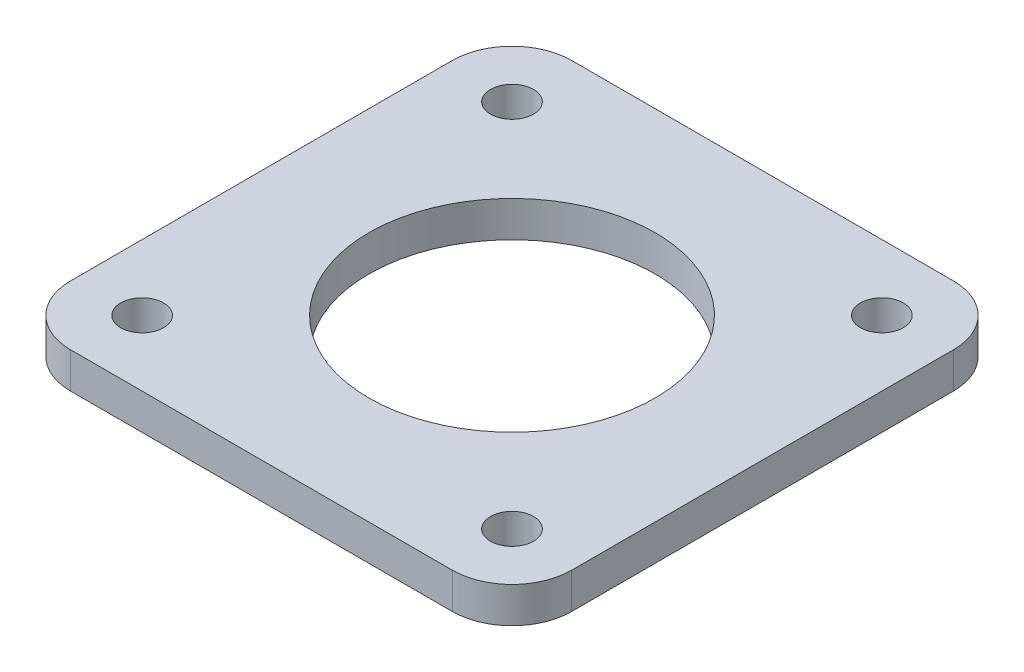
ISO-10303-21;
HEADER;
FILE_DESCRIPTION(('STEP AP214'),'2;1');
FILE_NAME('part.step','',(''),(''),'','','');
FILE_SCHEMA(('AUTOMOTIVE_DESIGN { 1 0 10303 214 1 1 1 1 }'));
ENDSEC;
DATA;
#1=APPLICATION_CONTEXT('core data for automotive mechanical design processes');
#2=APPLICATION_PROTOCOL_DEFINITION('international standard','automotive_design',2000,#1);
#3=PRODUCT_CONTEXT('',#1,'mechanical');
#4=PRODUCT('Part','Part','',(#3));
#5=PRODUCT_RELATED_PRODUCT_CATEGORY('part','',(#4));
#6=PRODUCT_DEFINITION_FORMATION('','',#4);
#7=PRODUCT_DEFINITION_CONTEXT('part definition',#1,'design');
#8=PRODUCT_DEFINITION('design','',#6,#7);
#9=PRODUCT_DEFINITION_SHAPE('','',#8);
#10=(LENGTH_UNIT() NAMED_UNIT(*) SI_UNIT(.MILLI.,.METRE.));
#11=(NAMED_UNIT(*) PLANE_ANGLE_UNIT() SI_UNIT($,.RADIAN.));
#12=(NAMED_UNIT(*) SI_UNIT($,.STERADIAN.) SOLID_ANGLE_UNIT());
#13=UNCERTAINTY_MEASURE_WITH_UNIT(LENGTH_MEASURE(1.E-05),#10,'distance_accuracy_value','');
#14=(GEOMETRIC_REPRESENTATION_CONTEXT(3) GLOBAL_UNCERTAINTY_ASSIGNED_CONTEXT((#13)) GLOBAL_UNIT_ASSIGNED_CONTEXT((#10,
#11,#12)) REPRESENTATION_CONTEXT('',''));
#15=CARTESIAN_POINT('',(0.,0.,0.));
#16=DIRECTION('',(0.,0.,1.));
#17=DIRECTION('',(1.,0.,0.));
#18=AXIS2_PLACEMENT_3D('',#15,#16,#17);
#19=CARTESIAN_POINT('',(0.,3.,0.));
#20=DIRECTION('',(0.,-1.,0.));
#21=DIRECTION('',(0.,0.,-1.));
#22=AXIS2_PLACEMENT_3D('',#19,#20,#21);
#23=PLANE('',#22);
#24=CARTESIAN_POINT('',(0.,3.,0.));
#25=DIRECTION('',(0.,1.,0.));
#26=DIRECTION('',(0.,0.,1.));
#27=AXIS2_PLACEMENT_3D('',#24,#25,#26);
#28=CIRCLE('',#27,12.);
#29=CARTESIAN_POINT('',(0.,3.,12.));
#30=VERTEX_POINT('',#29);
#31=EDGE_CURVE('E201',#30,#30,#28,.T.);
#32=ORIENTED_EDGE('',*,*,#31,.F.);
#33=EDGE_LOOP('',(#32));
#34=FACE_BOUND('',#33,.T.);
#35=CARTESIAN_POINT('',(-15.5,3.,15.5));
#36=DIRECTION('',(0.,1.,0.));
#37=DIRECTION('',(0.,0.,1.));
#38=AXIS2_PLACEMENT_3D('',#35,#36,#37);
#39=CIRCLE('',#38,1.8);
#40=CARTESIAN_POINT('',(-15.5,3.,17.3));
#41=VERTEX_POINT('',#40);
#42=EDGE_CURVE('E191',#41,#41,#39,.T.);
#43=ORIENTED_EDGE('',*,*,#42,.F.);
#44=EDGE_LOOP('',(#43));
#45=FACE_BOUND('',#44,.T.);
#46=CARTESIAN_POINT('',(15.5,3.,15.5));
#47=DIRECTION('',(0.,1.,0.));
#48=DIRECTION('',(0.,0.,1.));
#49=AXIS2_PLACEMENT_3D('',#46,#47,#48);
#50=CIRCLE('',#49,1.8);
#51=CARTESIAN_POINT('',(15.5,3.,17.3));
#52=VERTEX_POINT('',#51);
#53=EDGE_CURVE('E185',#52,#52,#50,.T.);
#54=ORIENTED_EDGE('',*,*,#53,.F.);
#55=EDGE_LOOP('',(#54));
#56=FACE_BOUND('',#55,.T.);
#57=CARTESIAN_POINT('',(15.5,3.,-15.5));
#58=DIRECTION('',(0.,1.,0.));
#59=DIRECTION('',(0.,0.,1.));
#60=AXIS2_PLACEMENT_3D('',#57,#58,#59);
#61=CIRCLE('',#60,1.8);
#62=CARTESIAN_POINT('',(15.5,3.,-13.7));
#63=VERTEX_POINT('',#62);
#64=EDGE_CURVE('E133',#63,#63,#61,.T.);
#65=ORIENTED_EDGE('',*,*,#64,.F.);
#66=EDGE_LOOP('',(#65));
#67=FACE_BOUND('',#66,.T.);
#68=DIRECTION('',(-1.,0.,0.));
#69=VECTOR('',#68,1.);
#70=CARTESIAN_POINT('',(21.,3.,-21.));
#71=LINE('',#70,#69);
#72=CARTESIAN_POINT('',(16.,3.,-21.));
#73=VERTEX_POINT('',#72);
#74=CARTESIAN_POINT('',(-16.,3.,-21.));
#75=VERTEX_POINT('',#74);
#76=EDGE_CURVE('E136',#73,#75,#71,.T.);
#77=ORIENTED_EDGE('',*,*,#76,.T.);
#78=CARTESIAN_POINT('',(-16.,3.,-16.));
#79=DIRECTION('',(0.,-1.,0.));
#80=DIRECTION('',(0.,0.,-1.));
#81=AXIS2_PLACEMENT_3D('',#78,#79,#80);
#82=CIRCLE('',#81,5.);
#83=CARTESIAN_POINT('',(-21.,3.,-16.));
#84=VERTEX_POINT('',#83);
#85=EDGE_CURVE('E155',#75,#84,#82,.F.);
#86=ORIENTED_EDGE('',*,*,#85,.T.);
#87=DIRECTION('',(0.,0.,1.));
#88=VECTOR('',#87,1.);
#89=CARTESIAN_POINT('',(-21.,3.,-21.));
#90=LINE('',#89,#88);
#91=CARTESIAN_POINT('',(-21.,3.,16.));
#92=VERTEX_POINT('',#91);
#93=EDGE_CURVE('E119',#84,#92,#90,.T.);
#94=ORIENTED_EDGE('',*,*,#93,.T.);
#95=CARTESIAN_POINT('',(-16.,3.,16.));
#96=DIRECTION('',(0.,-1.,0.));
#97=DIRECTION('',(0.,0.,-1.));
#98=AXIS2_PLACEMENT_3D('',#95,#96,#97);
#99=CIRCLE('',#98,5.);
#100=CARTESIAN_POINT('',(-16.,3.,21.));
#101=VERTEX_POINT('',#100);
#102=EDGE_CURVE('E150',#92,#101,#99,.F.);
#103=ORIENTED_EDGE('',*,*,#102,.T.);
#104=DIRECTION('',(1.,0.,0.));
#105=VECTOR('',#104,1.);
#106=CARTESIAN_POINT('',(21.,3.,21.));
#107=LINE('',#106,#105);
#108=CARTESIAN_POINT('',(16.,3.,21.));
#109=VERTEX_POINT('',#108);
#110=EDGE_CURVE('E166',#101,#109,#107,.T.);
#111=ORIENTED_EDGE('',*,*,#110,.T.);
#112=CARTESIAN_POINT('',(16.,3.,16.));
#113=DIRECTION('',(0.,-1.,0.));
#114=DIRECTION('',(0.,0.,-1.));
#115=AXIS2_PLACEMENT_3D('',#112,#113,#114);
#116=CIRCLE('',#115,5.);
#117=CARTESIAN_POINT('',(21.,3.,16.));
#118=VERTEX_POINT('',#117);
#119=EDGE_CURVE('E55',#109,#118,#116,.F.);
#120=ORIENTED_EDGE('',*,*,#119,.T.);
#121=DIRECTION('',(0.,0.,-1.));
#122=VECTOR('',#121,1.);
#123=CARTESIAN_POINT('',(21.,3.,-21.));
#124=LINE('',#123,#122);
#125=CARTESIAN_POINT('',(21.,3.,-16.));
#126=VERTEX_POINT('',#125);
#127=EDGE_CURVE('E174',#118,#126,#124,.T.);
#128=ORIENTED_EDGE('',*,*,#127,.T.);
#129=CARTESIAN_POINT('',(16.,3.,-16.));
#130=DIRECTION('',(0.,-1.,0.));
#131=DIRECTION('',(0.,0.,-1.));
#132=AXIS2_PLACEMENT_3D('',#129,#130,#131);
#133=CIRCLE('',#132,5.);
#134=EDGE_CURVE('E153',#126,#73,#133,.F.);
#135=ORIENTED_EDGE('',*,*,#134,.T.);
#136=EDGE_LOOP('',(#77,#86,#94,#103,#111,#120,#128,#135));
#137=FACE_BOUND('',#136,.T.);
#138=CARTESIAN_POINT('',(-15.5,3.,-15.5));
#139=DIRECTION('',(0.,1.,0.));
#140=DIRECTION('',(0.,0.,1.));
#141=AXIS2_PLACEMENT_3D('',#138,#139,#140);
#142=CIRCLE('',#141,1.8);
#143=CARTESIAN_POINT('',(-15.5,3.,-13.7));
#144=VERTEX_POINT('',#143);
#145=EDGE_CURVE('E197',#144,#144,#142,.T.);
#146=ORIENTED_EDGE('',*,*,#145,.F.);
#147=EDGE_LOOP('',(#146));
#148=FACE_BOUND('',#147,.T.);
#149=ADVANCED_FACE('F33',(#34,#45,#56,#67,#137,#148),#23,.F.);
#150=CARTESIAN_POINT('',(0.,0.,0.));
#151=DIRECTION('',(0.,-1.,0.));
#152=DIRECTION('',(0.,0.,-1.));
#153=AXIS2_PLACEMENT_3D('',#150,#151,#152);
#154=PLANE('',#153);
#155=CARTESIAN_POINT('',(0.,0.,0.));
#156=DIRECTION('',(0.,1.,0.));
#157=DIRECTION('',(0.,0.,1.));
#158=AXIS2_PLACEMENT_3D('',#155,#156,#157);
#159=CIRCLE('',#158,12.);
#160=CARTESIAN_POINT('',(0.,0.,12.));
#161=VERTEX_POINT('',#160);
#162=EDGE_CURVE('E200',#161,#161,#159,.T.);
#163=ORIENTED_EDGE('',*,*,#162,.T.);
#164=EDGE_LOOP('',(#163));
#165=FACE_BOUND('',#164,.T.);
#166=CARTESIAN_POINT('',(-15.5,0.,-15.5));
#167=DIRECTION('',(0.,1.,0.));
#168=DIRECTION('',(0.,0.,1.));
#169=AXIS2_PLACEMENT_3D('',#166,#167,#168);
#170=CIRCLE('',#169,1.8);
#171=CARTESIAN_POINT('',(-15.5,0.,-13.7));
#172=VERTEX_POINT('',#171);
#173=EDGE_CURVE('E194',#172,#172,#170,.T.);
#174=ORIENTED_EDGE('',*,*,#173,.T.);
#175=EDGE_LOOP('',(#174));
#176=FACE_BOUND('',#175,.T.);
#177=DIRECTION('',(0.,0.,1.));
#178=VECTOR('',#177,1.);
#179=CARTESIAN_POINT('',(-21.,0.,-21.));
#180=LINE('',#179,#178);
#181=CARTESIAN_POINT('',(-21.,0.,-16.));
#182=VERTEX_POINT('',#181);
#183=CARTESIAN_POINT('',(-21.,0.,16.));
#184=VERTEX_POINT('',#183);
#185=EDGE_CURVE('E116',#182,#184,#180,.T.);
#186=ORIENTED_EDGE('',*,*,#185,.F.);
#187=CARTESIAN_POINT('',(-16.,0.,-16.));
#188=DIRECTION('',(0.,-1.,0.));
#189=DIRECTION('',(0.,0.,-1.));
#190=AXIS2_PLACEMENT_3D('',#187,#188,#189);
#191=CIRCLE('',#190,5.);
#192=CARTESIAN_POINT('',(-16.,0.,-21.));
#193=VERTEX_POINT('',#192);
#194=EDGE_CURVE('E99',#182,#193,#191,.T.);
#195=ORIENTED_EDGE('',*,*,#194,.T.);
#196=DIRECTION('',(-1.,0.,0.));
#197=VECTOR('',#196,1.);
#198=CARTESIAN_POINT('',(21.,0.,-21.));
#199=LINE('',#198,#197);
#200=CARTESIAN_POINT('',(16.,0.,-21.));
#201=VERTEX_POINT('',#200);
#202=EDGE_CURVE('E140',#201,#193,#199,.T.);
#203=ORIENTED_EDGE('',*,*,#202,.F.);
#204=CARTESIAN_POINT('',(16.,0.,-16.));
#205=DIRECTION('',(0.,-1.,0.));
#206=DIRECTION('',(0.,0.,-1.));
#207=AXIS2_PLACEMENT_3D('',#204,#205,#206);
#208=CIRCLE('',#207,5.);
#209=CARTESIAN_POINT('',(21.,0.,-16.));
#210=VERTEX_POINT('',#209);
#211=EDGE_CURVE('E110',#201,#210,#208,.T.);
#212=ORIENTED_EDGE('',*,*,#211,.T.);
#213=DIRECTION('',(0.,0.,-1.));
#214=VECTOR('',#213,1.);
#215=CARTESIAN_POINT('',(21.,0.,-21.));
#216=LINE('',#215,#214);
#217=CARTESIAN_POINT('',(21.,0.,16.));
#218=VERTEX_POINT('',#217);
#219=EDGE_CURVE('E130',#218,#210,#216,.T.);
#220=ORIENTED_EDGE('',*,*,#219,.F.);
#221=CARTESIAN_POINT('',(16.,0.,16.));
#222=DIRECTION('',(0.,-1.,0.));
#223=DIRECTION('',(0.,0.,-1.));
#224=AXIS2_PLACEMENT_3D('',#221,#222,#223);
#225=CIRCLE('',#224,5.);
#226=CARTESIAN_POINT('',(16.,0.,21.));
#227=VERTEX_POINT('',#226);
#228=EDGE_CURVE('E144',#218,#227,#225,.T.);
#229=ORIENTED_EDGE('',*,*,#228,.T.);
#230=DIRECTION('',(1.,0.,0.));
#231=VECTOR('',#230,1.);
#232=CARTESIAN_POINT('',(21.,0.,21.));
#233=LINE('',#232,#231);
#234=CARTESIAN_POINT('',(-16.,0.,21.));
#235=VERTEX_POINT('',#234);
#236=EDGE_CURVE('E126',#235,#227,#233,.T.);
#237=ORIENTED_EDGE('',*,*,#236,.F.);
#238=CARTESIAN_POINT('',(-16.,0.,16.));
#239=DIRECTION('',(0.,-1.,0.));
#240=DIRECTION('',(0.,0.,-1.));
#241=AXIS2_PLACEMENT_3D('',#238,#239,#240);
#242=CIRCLE('',#241,5.);
#243=EDGE_CURVE('E120',#235,#184,#242,.T.);
#244=ORIENTED_EDGE('',*,*,#243,.T.);
#245=EDGE_LOOP('',(#186,#195,#203,#212,#220,#229,#237,#244));
#246=FACE_BOUND('',#245,.T.);
#247=CARTESIAN_POINT('',(15.5,0.,-15.5));
#248=DIRECTION('',(0.,1.,0.));
#249=DIRECTION('',(0.,0.,1.));
#250=AXIS2_PLACEMENT_3D('',#247,#248,#249);
#251=CIRCLE('',#250,1.8);
#252=CARTESIAN_POINT('',(15.5,0.,-13.7));
#253=VERTEX_POINT('',#252);
#254=EDGE_CURVE('E127',#253,#253,#251,.T.);
#255=ORIENTED_EDGE('',*,*,#254,.T.);
#256=EDGE_LOOP('',(#255));
#257=FACE_BOUND('',#256,.T.);
#258=CARTESIAN_POINT('',(15.5,0.,15.5));
#259=DIRECTION('',(0.,1.,0.));
#260=DIRECTION('',(0.,0.,1.));
#261=AXIS2_PLACEMENT_3D('',#258,#259,#260);
#262=CIRCLE('',#261,1.8);
#263=CARTESIAN_POINT('',(15.5,0.,17.3));
#264=VERTEX_POINT('',#263);
#265=EDGE_CURVE('E182',#264,#264,#262,.T.);
#266=ORIENTED_EDGE('',*,*,#265,.T.);
#267=EDGE_LOOP('',(#266));
#268=FACE_BOUND('',#267,.T.);
#269=CARTESIAN_POINT('',(-15.5,0.,15.5));
#270=DIRECTION('',(0.,1.,0.));
#271=DIRECTION('',(0.,0.,1.));
#272=AXIS2_PLACEMENT_3D('',#269,#270,#271);
#273=CIRCLE('',#272,1.8);
#274=CARTESIAN_POINT('',(-15.5,0.,17.3));
#275=VERTEX_POINT('',#274);
#276=EDGE_CURVE('E188',#275,#275,#273,.T.);
#277=ORIENTED_EDGE('',*,*,#276,.T.);
#278=EDGE_LOOP('',(#277));
#279=FACE_BOUND('',#278,.T.);
#280=ADVANCED_FACE('F123',(#165,#176,#246,#257,#268,#279),#154,.T.);
#281=CARTESIAN_POINT('',(-21.,3.,-21.));
#282=DIRECTION('',(1.,0.,0.));
#283=DIRECTION('',(0.,0.,-1.));
#284=AXIS2_PLACEMENT_3D('',#281,#282,#283);
#285=PLANE('',#284);
#286=ORIENTED_EDGE('',*,*,#93,.F.);
#287=DIRECTION('',(0.,-1.,0.));
#288=VECTOR('',#287,1.);
#289=CARTESIAN_POINT('',(-21.,3.,-16.));
#290=LINE('',#289,#288);
#291=EDGE_CURVE('E103',#84,#182,#290,.T.);
#292=ORIENTED_EDGE('',*,*,#291,.T.);
#293=ORIENTED_EDGE('',*,*,#185,.T.);
#294=DIRECTION('',(0.,-1.,0.));
#295=VECTOR('',#294,1.);
#296=CARTESIAN_POINT('',(-21.,3.,16.));
#297=LINE('',#296,#295);
#298=EDGE_CURVE('E121',#184,#92,#297,.F.);
#299=ORIENTED_EDGE('',*,*,#298,.T.);
#300=EDGE_LOOP('',(#286,#292,#293,#299));
#301=FACE_BOUND('',#300,.T.);
#302=ADVANCED_FACE('F115',(#301),#285,.F.);
#303=CARTESIAN_POINT('',(21.,3.,21.));
#304=DIRECTION('',(0.,0.,-1.));
#305=DIRECTION('',(-1.,0.,0.));
#306=AXIS2_PLACEMENT_3D('',#303,#304,#305);
#307=PLANE('',#306);
#308=ORIENTED_EDGE('',*,*,#236,.T.);
#309=DIRECTION('',(0.,-1.,0.));
#310=VECTOR('',#309,1.);
#311=CARTESIAN_POINT('',(16.,3.,21.));
#312=LINE('',#311,#310);
#313=EDGE_CURVE('E11',#227,#109,#312,.F.);
#314=ORIENTED_EDGE('',*,*,#313,.T.);
#315=ORIENTED_EDGE('',*,*,#110,.F.);
#316=DIRECTION('',(0.,-1.,0.));
#317=VECTOR('',#316,1.);
#318=CARTESIAN_POINT('',(-16.,3.,21.));
#319=LINE('',#318,#317);
#320=EDGE_CURVE('E41',#101,#235,#319,.T.);
#321=ORIENTED_EDGE('',*,*,#320,.T.);
#322=EDGE_LOOP('',(#308,#314,#315,#321));
#323=FACE_BOUND('',#322,.T.);
#324=ADVANCED_FACE('F164',(#323),#307,.F.);
#325=CARTESIAN_POINT('',(21.,3.,-21.));
#326=DIRECTION('',(-1.,0.,0.));
#327=DIRECTION('',(0.,0.,1.));
#328=AXIS2_PLACEMENT_3D('',#325,#326,#327);
#329=PLANE('',#328);
#330=ORIENTED_EDGE('',*,*,#219,.T.);
#331=DIRECTION('',(0.,-1.,0.));
#332=VECTOR('',#331,1.);
#333=CARTESIAN_POINT('',(21.,3.,-16.));
#334=LINE('',#333,#332);
#335=EDGE_CURVE('E48',#210,#126,#334,.F.);
#336=ORIENTED_EDGE('',*,*,#335,.T.);
#337=ORIENTED_EDGE('',*,*,#127,.F.);
#338=DIRECTION('',(0.,-1.,0.));
#339=VECTOR('',#338,1.);
#340=CARTESIAN_POINT('',(21.,3.,16.));
#341=LINE('',#340,#339);
#342=EDGE_CURVE('E157',#118,#218,#341,.T.);
#343=ORIENTED_EDGE('',*,*,#342,.T.);
#344=EDGE_LOOP('',(#330,#336,#337,#343));
#345=FACE_BOUND('',#344,.T.);
#346=ADVANCED_FACE('F173',(#345),#329,.F.);
#347=CARTESIAN_POINT('',(21.,3.,-21.));
#348=DIRECTION('',(0.,0.,1.));
#349=DIRECTION('',(1.,0.,0.));
#350=AXIS2_PLACEMENT_3D('',#347,#348,#349);
#351=PLANE('',#350);
#352=ORIENTED_EDGE('',*,*,#202,.T.);
#353=DIRECTION('',(0.,-1.,0.));
#354=VECTOR('',#353,1.);
#355=CARTESIAN_POINT('',(-16.,3.,-21.));
#356=LINE('',#355,#354);
#357=EDGE_CURVE('E104',#193,#75,#356,.F.);
#358=ORIENTED_EDGE('',*,*,#357,.T.);
#359=ORIENTED_EDGE('',*,*,#76,.F.);
#360=DIRECTION('',(0.,-1.,0.));
#361=VECTOR('',#360,1.);
#362=CARTESIAN_POINT('',(16.,3.,-21.));
#363=LINE('',#362,#361);
#364=EDGE_CURVE('E109',#73,#201,#363,.T.);
#365=ORIENTED_EDGE('',*,*,#364,.T.);
#366=EDGE_LOOP('',(#352,#358,#359,#365));
#367=FACE_BOUND('',#366,.T.);
#368=ADVANCED_FACE('F245',(#367),#351,.F.);
#369=CARTESIAN_POINT('',(15.5,3.,-15.5));
#370=DIRECTION('',(0.,1.,0.));
#371=DIRECTION('',(0.,0.,1.));
#372=AXIS2_PLACEMENT_3D('',#369,#370,#371);
#373=CYLINDRICAL_SURFACE('',#372,1.8);
#374=ORIENTED_EDGE('',*,*,#254,.F.);
#375=EDGE_LOOP('',(#374));
#376=FACE_BOUND('',#375,.T.);
#377=ORIENTED_EDGE('',*,*,#64,.T.);
#378=EDGE_LOOP('',(#377));
#379=FACE_BOUND('',#378,.T.);
#380=ADVANCED_FACE('F242',(#376,#379),#373,.F.);
#381=CARTESIAN_POINT('',(15.5,3.,15.5));
#382=DIRECTION('',(0.,1.,0.));
#383=DIRECTION('',(0.,0.,1.));
#384=AXIS2_PLACEMENT_3D('',#381,#382,#383);
#385=CYLINDRICAL_SURFACE('',#384,1.8);
#386=ORIENTED_EDGE('',*,*,#265,.F.);
#387=EDGE_LOOP('',(#386));
#388=FACE_BOUND('',#387,.T.);
#389=ORIENTED_EDGE('',*,*,#53,.T.);
#390=EDGE_LOOP('',(#389));
#391=FACE_BOUND('',#390,.T.);
#392=ADVANCED_FACE('F235',(#388,#391),#385,.F.);
#393=CARTESIAN_POINT('',(-15.5,3.,15.5));
#394=DIRECTION('',(0.,1.,0.));
#395=DIRECTION('',(0.,0.,1.));
#396=AXIS2_PLACEMENT_3D('',#393,#394,#395);
#397=CYLINDRICAL_SURFACE('',#396,1.8);
#398=ORIENTED_EDGE('',*,*,#276,.F.);
#399=EDGE_LOOP('',(#398));
#400=FACE_BOUND('',#399,.T.);
#401=ORIENTED_EDGE('',*,*,#42,.T.);
#402=EDGE_LOOP('',(#401));
#403=FACE_BOUND('',#402,.T.);
#404=ADVANCED_FACE('F229',(#400,#403),#397,.F.);
#405=CARTESIAN_POINT('',(-15.5,3.,-15.5));
#406=DIRECTION('',(0.,1.,0.));
#407=DIRECTION('',(0.,0.,1.));
#408=AXIS2_PLACEMENT_3D('',#405,#406,#407);
#409=CYLINDRICAL_SURFACE('',#408,1.8);
#410=ORIENTED_EDGE('',*,*,#173,.F.);
#411=EDGE_LOOP('',(#410));
#412=FACE_BOUND('',#411,.T.);
#413=ORIENTED_EDGE('',*,*,#145,.T.);
#414=EDGE_LOOP('',(#413));
#415=FACE_BOUND('',#414,.T.);
#416=ADVANCED_FACE('F212',(#412,#415),#409,.F.);
#417=CARTESIAN_POINT('',(0.,0.,0.));
#418=DIRECTION('',(0.,1.,0.));
#419=DIRECTION('',(0.,0.,1.));
#420=AXIS2_PLACEMENT_3D('',#417,#418,#419);
#421=CYLINDRICAL_SURFACE('',#420,12.);
#422=ORIENTED_EDGE('',*,*,#162,.F.);
#423=EDGE_LOOP('',(#422));
#424=FACE_BOUND('',#423,.T.);
#425=ORIENTED_EDGE('',*,*,#31,.T.);
#426=EDGE_LOOP('',(#425));
#427=FACE_BOUND('',#426,.T.);
#428=ADVANCED_FACE('F209',(#424,#427),#421,.F.);
#429=CARTESIAN_POINT('',(-16.,3.,-16.));
#430=DIRECTION('',(0.,-1.,0.));
#431=DIRECTION('',(0.,0.,-1.));
#432=AXIS2_PLACEMENT_3D('',#429,#430,#431);
#433=CYLINDRICAL_SURFACE('',#432,5.);
#434=ORIENTED_EDGE('',*,*,#85,.F.);
#435=ORIENTED_EDGE('',*,*,#357,.F.);
#436=ORIENTED_EDGE('',*,*,#194,.F.);
#437=ORIENTED_EDGE('',*,*,#291,.F.);
#438=EDGE_LOOP('',(#434,#435,#436,#437));
#439=FACE_BOUND('',#438,.T.);
#440=ADVANCED_FACE('F102',(#439),#433,.T.);
#441=CARTESIAN_POINT('',(16.,3.,-16.));
#442=DIRECTION('',(0.,-1.,0.));
#443=DIRECTION('',(0.,0.,-1.));
#444=AXIS2_PLACEMENT_3D('',#441,#442,#443);
#445=CYLINDRICAL_SURFACE('',#444,5.);
#446=ORIENTED_EDGE('',*,*,#134,.F.);
#447=ORIENTED_EDGE('',*,*,#335,.F.);
#448=ORIENTED_EDGE('',*,*,#211,.F.);
#449=ORIENTED_EDGE('',*,*,#364,.F.);
#450=EDGE_LOOP('',(#446,#447,#448,#449));
#451=FACE_BOUND('',#450,.T.);
#452=ADVANCED_FACE('F261',(#451),#445,.T.);
#453=CARTESIAN_POINT('',(16.,3.,16.));
#454=DIRECTION('',(0.,-1.,0.));
#455=DIRECTION('',(0.,0.,-1.));
#456=AXIS2_PLACEMENT_3D('',#453,#454,#455);
#457=CYLINDRICAL_SURFACE('',#456,5.);
#458=ORIENTED_EDGE('',*,*,#119,.F.);
#459=ORIENTED_EDGE('',*,*,#313,.F.);
#460=ORIENTED_EDGE('',*,*,#228,.F.);
#461=ORIENTED_EDGE('',*,*,#342,.F.);
#462=EDGE_LOOP('',(#458,#459,#460,#461));
#463=FACE_BOUND('',#462,.T.);
#464=ADVANCED_FACE('F172',(#463),#457,.T.);
#465=CARTESIAN_POINT('',(-16.,3.,16.));
#466=DIRECTION('',(0.,-1.,0.));
#467=DIRECTION('',(0.,0.,-1.));
#468=AXIS2_PLACEMENT_3D('',#465,#466,#467);
#469=CYLINDRICAL_SURFACE('',#468,5.);
#470=ORIENTED_EDGE('',*,*,#102,.F.);
#471=ORIENTED_EDGE('',*,*,#298,.F.);
#472=ORIENTED_EDGE('',*,*,#243,.F.);
#473=ORIENTED_EDGE('',*,*,#320,.F.);
#474=EDGE_LOOP('',(#470,#471,#472,#473));
#475=FACE_BOUND('',#474,.T.);
#476=ADVANCED_FACE('F35',(#475),#469,.T.);
#477=CLOSED_SHELL('',(#149,#280,#302,#324,#346,#368,#380,#392,#404,#416,#428,#440,#452,#464,#476));
#478=MANIFOLD_SOLID_BREP('B2',#477);
#479=ADVANCED_BREP_SHAPE_REPRESENTATION('',(#18,#478),#14);
#480=SHAPE_DEFINITION_REPRESENTATION(#9,#479);
ENDSEC;
END-ISO-10303-21;
